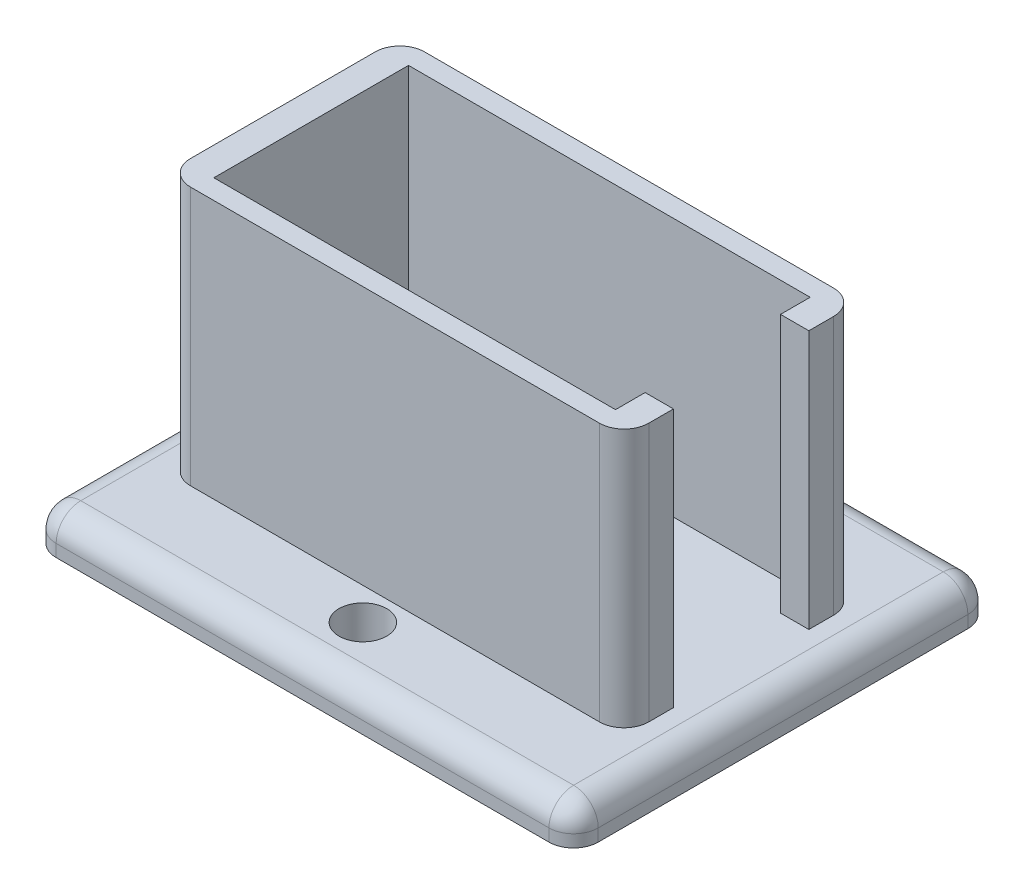
ISO-10303-21;
HEADER;
FILE_DESCRIPTION(('STEP AP214'),'2;1');
FILE_NAME('part.step','',(''),(''),'','','');
FILE_SCHEMA(('AUTOMOTIVE_DESIGN { 1 0 10303 214 1 1 1 1 }'));
ENDSEC;
DATA;
#1=APPLICATION_CONTEXT('core data for automotive mechanical design processes');
#2=APPLICATION_PROTOCOL_DEFINITION('international standard','automotive_design',2000,#1);
#3=PRODUCT_CONTEXT('',#1,'mechanical');
#4=PRODUCT('Part','Part','',(#3));
#5=PRODUCT_RELATED_PRODUCT_CATEGORY('part','',(#4));
#6=PRODUCT_DEFINITION_FORMATION('','',#4);
#7=PRODUCT_DEFINITION_CONTEXT('part definition',#1,'design');
#8=PRODUCT_DEFINITION('design','',#6,#7);
#9=PRODUCT_DEFINITION_SHAPE('','',#8);
#10=(LENGTH_UNIT() NAMED_UNIT(*) SI_UNIT(.MILLI.,.METRE.));
#11=(NAMED_UNIT(*) PLANE_ANGLE_UNIT() SI_UNIT($,.RADIAN.));
#12=(NAMED_UNIT(*) SI_UNIT($,.STERADIAN.) SOLID_ANGLE_UNIT());
#13=UNCERTAINTY_MEASURE_WITH_UNIT(LENGTH_MEASURE(1.E-05),#10,'distance_accuracy_value','');
#14=(GEOMETRIC_REPRESENTATION_CONTEXT(3) GLOBAL_UNCERTAINTY_ASSIGNED_CONTEXT((#13)) GLOBAL_UNIT_ASSIGNED_CONTEXT((#10,
#11,#12)) REPRESENTATION_CONTEXT('',''));
#15=CARTESIAN_POINT('',(0.,0.,0.));
#16=DIRECTION('',(0.,0.,1.));
#17=DIRECTION('',(1.,0.,0.));
#18=AXIS2_PLACEMENT_3D('',#15,#16,#17);
#19=CARTESIAN_POINT('',(23.622,30.48,12.065));
#20=DIRECTION('',(-1.,0.,0.));
#21=DIRECTION('',(0.,0.,1.));
#22=AXIS2_PLACEMENT_3D('',#19,#20,#21);
#23=PLANE('',#22);
#24=DIRECTION('',(0.,0.,-1.));
#25=VECTOR('',#24,1.);
#26=CARTESIAN_POINT('',(23.622,30.48,12.065));
#27=LINE('',#26,#25);
#28=CARTESIAN_POINT('',(23.622,30.48,-6.9778855003284));
#29=VERTEX_POINT('',#28);
#30=CARTESIAN_POINT('',(23.622,30.48,-9.525));
#31=VERTEX_POINT('',#30);
#32=EDGE_CURVE('E248',#29,#31,#27,.T.);
#33=ORIENTED_EDGE('',*,*,#32,.F.);
#34=DIRECTION('',(0.,1.,0.));
#35=VECTOR('',#34,1.);
#36=CARTESIAN_POINT('',(23.622,-10.6483117549332,-6.9778855003284));
#37=LINE('',#36,#35);
#38=CARTESIAN_POINT('',(23.622,3.81,-6.9778855003284));
#39=VERTEX_POINT('',#38);
#40=EDGE_CURVE('E239',#39,#29,#37,.T.);
#41=ORIENTED_EDGE('',*,*,#40,.F.);
#42=DIRECTION('',(0.,0.,-1.));
#43=VECTOR('',#42,1.);
#44=CARTESIAN_POINT('',(23.622,3.81,12.065));
#45=LINE('',#44,#43);
#46=CARTESIAN_POINT('',(23.622,3.81,-9.525));
#47=VERTEX_POINT('',#46);
#48=EDGE_CURVE('E270',#39,#47,#45,.T.);
#49=ORIENTED_EDGE('',*,*,#48,.T.);
#50=DIRECTION('',(0.,-1.,0.));
#51=VECTOR('',#50,1.);
#52=CARTESIAN_POINT('',(23.622,30.48,-9.525));
#53=LINE('',#52,#51);
#54=EDGE_CURVE('E360',#47,#31,#53,.F.);
#55=ORIENTED_EDGE('',*,*,#54,.T.);
#56=EDGE_LOOP('',(#33,#41,#49,#55));
#57=FACE_BOUND('',#56,.T.);
#58=ADVANCED_FACE('F44',(#57),#23,.F.);
#59=CARTESIAN_POINT('',(20.701,-42.1983683692434,10.033));
#60=DIRECTION('',(1.,0.,0.));
#61=DIRECTION('',(0.,0.,-1.));
#62=AXIS2_PLACEMENT_3D('',#59,#60,#61);
#63=PLANE('',#62);
#64=DIRECTION('',(0.,0.,-1.));
#65=VECTOR('',#64,1.);
#66=CARTESIAN_POINT('',(20.701,3.81,10.033));
#67=LINE('',#66,#65);
#68=CARTESIAN_POINT('',(20.701,3.81,-6.9778855003284));
#69=VERTEX_POINT('',#68);
#70=CARTESIAN_POINT('',(20.701,3.81,-10.033));
#71=VERTEX_POINT('',#70);
#72=EDGE_CURVE('E469',#69,#71,#67,.T.);
#73=ORIENTED_EDGE('',*,*,#72,.F.);
#74=DIRECTION('',(0.,1.,0.));
#75=VECTOR('',#74,1.);
#76=CARTESIAN_POINT('',(20.701,-42.1983683692434,-6.9778855003284));
#77=LINE('',#76,#75);
#78=CARTESIAN_POINT('',(20.701,30.48,-6.9778855003284));
#79=VERTEX_POINT('',#78);
#80=EDGE_CURVE('E11',#69,#79,#77,.T.);
#81=ORIENTED_EDGE('',*,*,#80,.T.);
#82=DIRECTION('',(0.,0.,-1.));
#83=VECTOR('',#82,1.);
#84=CARTESIAN_POINT('',(20.701,30.48,10.033));
#85=LINE('',#84,#83);
#86=CARTESIAN_POINT('',(20.701,30.48,-10.033));
#87=VERTEX_POINT('',#86);
#88=EDGE_CURVE('E509',#79,#87,#85,.T.);
#89=ORIENTED_EDGE('',*,*,#88,.T.);
#90=DIRECTION('',(0.,1.,0.));
#91=VECTOR('',#90,1.);
#92=CARTESIAN_POINT('',(20.701,-42.1983683692434,-10.033));
#93=LINE('',#92,#91);
#94=EDGE_CURVE('E257',#71,#87,#93,.T.);
#95=ORIENTED_EDGE('',*,*,#94,.F.);
#96=EDGE_LOOP('',(#73,#81,#89,#95));
#97=FACE_BOUND('',#96,.T.);
#98=ADVANCED_FACE('F544',(#97),#63,.F.);
#99=CARTESIAN_POINT('',(0.,0.,0.));
#100=DIRECTION('',(0.,-1.,0.));
#101=DIRECTION('',(0.,0.,-1.));
#102=AXIS2_PLACEMENT_3D('',#99,#100,#101);
#103=PLANE('',#102);
#104=CARTESIAN_POINT('',(0.,0.,15.373463192756));
#105=DIRECTION('',(0.,-1.,0.));
#106=DIRECTION('',(0.,0.,-1.));
#107=AXIS2_PLACEMENT_3D('',#104,#105,#106);
#108=CIRCLE('',#107,2.4618575720522);
#109=CARTESIAN_POINT('',(0.,0.,12.9116056207038));
#110=VERTEX_POINT('',#109);
#111=EDGE_CURVE('E524',#110,#110,#108,.T.);
#112=ORIENTED_EDGE('',*,*,#111,.F.);
#113=EDGE_LOOP('',(#112));
#114=FACE_BOUND('',#113,.T.);
#115=DIRECTION('',(0.,0.,1.));
#116=VECTOR('',#115,1.);
#117=CARTESIAN_POINT('',(-27.94,0.,21.59));
#118=LINE('',#117,#116);
#119=CARTESIAN_POINT('',(-27.94,0.,-19.05));
#120=VERTEX_POINT('',#119);
#121=CARTESIAN_POINT('',(-27.94,0.,19.05));
#122=VERTEX_POINT('',#121);
#123=EDGE_CURVE('E290',#120,#122,#118,.T.);
#124=ORIENTED_EDGE('',*,*,#123,.F.);
#125=CARTESIAN_POINT('',(-25.4,0.,-19.05));
#126=DIRECTION('',(0.,-1.,0.));
#127=DIRECTION('',(0.,0.,-1.));
#128=AXIS2_PLACEMENT_3D('',#125,#126,#127);
#129=CIRCLE('',#128,2.54);
#130=CARTESIAN_POINT('',(-25.4,0.,-21.59));
#131=VERTEX_POINT('',#130);
#132=EDGE_CURVE('E339',#120,#131,#129,.T.);
#133=ORIENTED_EDGE('',*,*,#132,.T.);
#134=DIRECTION('',(-1.,0.,0.));
#135=VECTOR('',#134,1.);
#136=CARTESIAN_POINT('',(-27.94,0.,-21.59));
#137=LINE('',#136,#135);
#138=CARTESIAN_POINT('',(25.4,0.,-21.59));
#139=VERTEX_POINT('',#138);
#140=EDGE_CURVE('E285',#139,#131,#137,.T.);
#141=ORIENTED_EDGE('',*,*,#140,.F.);
#142=CARTESIAN_POINT('',(25.4,0.,-19.05));
#143=DIRECTION('',(0.,-1.,0.));
#144=DIRECTION('',(0.,0.,-1.));
#145=AXIS2_PLACEMENT_3D('',#142,#143,#144);
#146=CIRCLE('',#145,2.54);
#147=CARTESIAN_POINT('',(27.94,0.,-19.05));
#148=VERTEX_POINT('',#147);
#149=EDGE_CURVE('E336',#139,#148,#146,.T.);
#150=ORIENTED_EDGE('',*,*,#149,.T.);
#151=DIRECTION('',(0.,0.,-1.));
#152=VECTOR('',#151,1.);
#153=CARTESIAN_POINT('',(27.94,0.,21.59));
#154=LINE('',#153,#152);
#155=CARTESIAN_POINT('',(27.94,0.,19.05));
#156=VERTEX_POINT('',#155);
#157=EDGE_CURVE('E281',#156,#148,#154,.T.);
#158=ORIENTED_EDGE('',*,*,#157,.F.);
#159=CARTESIAN_POINT('',(25.4,0.,19.05));
#160=DIRECTION('',(0.,-1.,0.));
#161=DIRECTION('',(0.,0.,-1.));
#162=AXIS2_PLACEMENT_3D('',#159,#160,#161);
#163=CIRCLE('',#162,2.54);
#164=CARTESIAN_POINT('',(25.4,0.,21.59));
#165=VERTEX_POINT('',#164);
#166=EDGE_CURVE('E333',#156,#165,#163,.T.);
#167=ORIENTED_EDGE('',*,*,#166,.T.);
#168=DIRECTION('',(1.,0.,0.));
#169=VECTOR('',#168,1.);
#170=CARTESIAN_POINT('',(-27.94,0.,21.59));
#171=LINE('',#170,#169);
#172=CARTESIAN_POINT('',(-25.4,0.,21.59));
#173=VERTEX_POINT('',#172);
#174=EDGE_CURVE('E294',#173,#165,#171,.T.);
#175=ORIENTED_EDGE('',*,*,#174,.F.);
#176=CARTESIAN_POINT('',(-25.4,0.,19.05));
#177=DIRECTION('',(0.,-1.,0.));
#178=DIRECTION('',(0.,0.,-1.));
#179=AXIS2_PLACEMENT_3D('',#176,#177,#178);
#180=CIRCLE('',#179,2.54);
#181=EDGE_CURVE('E330',#173,#122,#180,.T.);
#182=ORIENTED_EDGE('',*,*,#181,.T.);
#183=EDGE_LOOP('',(#124,#133,#141,#150,#158,#167,#175,#182));
#184=FACE_BOUND('',#183,.T.);
#185=CARTESIAN_POINT('',(0.,0.,-15.373463192756));
#186=DIRECTION('',(0.,-1.,0.));
#187=DIRECTION('',(0.,0.,-1.));
#188=AXIS2_PLACEMENT_3D('',#185,#186,#187);
#189=CIRCLE('',#188,2.4618575720522);
#190=CARTESIAN_POINT('',(0.,0.,-17.8353207648082));
#191=VERTEX_POINT('',#190);
#192=EDGE_CURVE('E511',#191,#191,#189,.F.);
#193=ORIENTED_EDGE('',*,*,#192,.T.);
#194=EDGE_LOOP('',(#193));
#195=FACE_BOUND('',#194,.T.);
#196=ADVANCED_FACE('F567',(#114,#184,#195),#103,.T.);
#197=CARTESIAN_POINT('',(27.94,3.81,21.59));
#198=DIRECTION('',(-1.,0.,0.));
#199=DIRECTION('',(0.,0.,1.));
#200=AXIS2_PLACEMENT_3D('',#197,#198,#199);
#201=PLANE('',#200);
#202=ORIENTED_EDGE('',*,*,#157,.T.);
#203=DIRECTION('',(0.,-1.,0.));
#204=VECTOR('',#203,1.);
#205=CARTESIAN_POINT('',(27.94,3.81,-19.05));
#206=LINE('',#205,#204);
#207=CARTESIAN_POINT('',(27.94,1.27,-19.05));
#208=VERTEX_POINT('',#207);
#209=EDGE_CURVE('E348',#148,#208,#206,.F.);
#210=ORIENTED_EDGE('',*,*,#209,.T.);
#211=DIRECTION('',(0.,0.,-1.));
#212=VECTOR('',#211,1.);
#213=CARTESIAN_POINT('',(27.94,1.27,21.59));
#214=LINE('',#213,#212);
#215=CARTESIAN_POINT('',(27.94,1.27,19.05));
#216=VERTEX_POINT('',#215);
#217=EDGE_CURVE('E345',#208,#216,#214,.F.);
#218=ORIENTED_EDGE('',*,*,#217,.T.);
#219=DIRECTION('',(0.,-1.,0.));
#220=VECTOR('',#219,1.);
#221=CARTESIAN_POINT('',(27.94,3.81,19.05));
#222=LINE('',#221,#220);
#223=EDGE_CURVE('E342',#216,#156,#222,.T.);
#224=ORIENTED_EDGE('',*,*,#223,.T.);
#225=EDGE_LOOP('',(#202,#210,#218,#224));
#226=FACE_BOUND('',#225,.T.);
#227=ADVANCED_FACE('F591',(#226),#201,.F.);
#228=CARTESIAN_POINT('',(-27.94,3.81,-21.59));
#229=DIRECTION('',(0.,0.,1.));
#230=DIRECTION('',(1.,0.,0.));
#231=AXIS2_PLACEMENT_3D('',#228,#229,#230);
#232=PLANE('',#231);
#233=ORIENTED_EDGE('',*,*,#140,.T.);
#234=DIRECTION('',(0.,-1.,0.));
#235=VECTOR('',#234,1.);
#236=CARTESIAN_POINT('',(-25.4,3.81,-21.59));
#237=LINE('',#236,#235);
#238=CARTESIAN_POINT('',(-25.4,1.27,-21.59));
#239=VERTEX_POINT('',#238);
#240=EDGE_CURVE('E318',#131,#239,#237,.F.);
#241=ORIENTED_EDGE('',*,*,#240,.T.);
#242=DIRECTION('',(-1.,0.,0.));
#243=VECTOR('',#242,1.);
#244=CARTESIAN_POINT('',(-27.94,1.27,-21.59));
#245=LINE('',#244,#243);
#246=CARTESIAN_POINT('',(25.4,1.27,-21.59));
#247=VERTEX_POINT('',#246);
#248=EDGE_CURVE('E314',#239,#247,#245,.F.);
#249=ORIENTED_EDGE('',*,*,#248,.T.);
#250=DIRECTION('',(0.,-1.,0.));
#251=VECTOR('',#250,1.);
#252=CARTESIAN_POINT('',(25.4,3.81,-21.59));
#253=LINE('',#252,#251);
#254=EDGE_CURVE('E311',#247,#139,#253,.T.);
#255=ORIENTED_EDGE('',*,*,#254,.T.);
#256=EDGE_LOOP('',(#233,#241,#249,#255));
#257=FACE_BOUND('',#256,.T.);
#258=ADVANCED_FACE('F776',(#257),#232,.F.);
#259=CARTESIAN_POINT('',(-27.94,3.81,21.59));
#260=DIRECTION('',(1.,0.,0.));
#261=DIRECTION('',(0.,0.,-1.));
#262=AXIS2_PLACEMENT_3D('',#259,#260,#261);
#263=PLANE('',#262);
#264=DIRECTION('',(0.,0.,1.));
#265=VECTOR('',#264,1.);
#266=CARTESIAN_POINT('',(-27.94,1.27,21.59));
#267=LINE('',#266,#265);
#268=CARTESIAN_POINT('',(-27.94,1.27,19.05));
#269=VERTEX_POINT('',#268);
#270=CARTESIAN_POINT('',(-27.94,1.27,-19.05));
#271=VERTEX_POINT('',#270);
#272=EDGE_CURVE('E324',#269,#271,#267,.F.);
#273=ORIENTED_EDGE('',*,*,#272,.T.);
#274=DIRECTION('',(0.,-1.,0.));
#275=VECTOR('',#274,1.);
#276=CARTESIAN_POINT('',(-27.94,3.81,-19.05));
#277=LINE('',#276,#275);
#278=EDGE_CURVE('E327',#271,#120,#277,.T.);
#279=ORIENTED_EDGE('',*,*,#278,.T.);
#280=ORIENTED_EDGE('',*,*,#123,.T.);
#281=DIRECTION('',(0.,-1.,0.));
#282=VECTOR('',#281,1.);
#283=CARTESIAN_POINT('',(-27.94,3.81,19.05));
#284=LINE('',#283,#282);
#285=EDGE_CURVE('E321',#122,#269,#284,.F.);
#286=ORIENTED_EDGE('',*,*,#285,.T.);
#287=EDGE_LOOP('',(#273,#279,#280,#286));
#288=FACE_BOUND('',#287,.T.);
#289=ADVANCED_FACE('F766',(#288),#263,.F.);
#290=CARTESIAN_POINT('',(-27.94,3.81,21.59));
#291=DIRECTION('',(0.,0.,-1.));
#292=DIRECTION('',(-1.,0.,0.));
#293=AXIS2_PLACEMENT_3D('',#290,#291,#292);
#294=PLANE('',#293);
#295=ORIENTED_EDGE('',*,*,#174,.T.);
#296=DIRECTION('',(0.,-1.,0.));
#297=VECTOR('',#296,1.);
#298=CARTESIAN_POINT('',(25.4,3.81,21.59));
#299=LINE('',#298,#297);
#300=CARTESIAN_POINT('',(25.4,1.27,21.59));
#301=VERTEX_POINT('',#300);
#302=EDGE_CURVE('E357',#165,#301,#299,.F.);
#303=ORIENTED_EDGE('',*,*,#302,.T.);
#304=DIRECTION('',(1.,0.,0.));
#305=VECTOR('',#304,1.);
#306=CARTESIAN_POINT('',(-27.94,1.27,21.59));
#307=LINE('',#306,#305);
#308=CARTESIAN_POINT('',(-25.4,1.27,21.59));
#309=VERTEX_POINT('',#308);
#310=EDGE_CURVE('E354',#301,#309,#307,.F.);
#311=ORIENTED_EDGE('',*,*,#310,.T.);
#312=DIRECTION('',(0.,-1.,0.));
#313=VECTOR('',#312,1.);
#314=CARTESIAN_POINT('',(-25.4,3.81,21.59));
#315=LINE('',#314,#313);
#316=EDGE_CURVE('E351',#309,#173,#315,.T.);
#317=ORIENTED_EDGE('',*,*,#316,.T.);
#318=EDGE_LOOP('',(#295,#303,#311,#317));
#319=FACE_BOUND('',#318,.T.);
#320=ADVANCED_FACE('F632',(#319),#294,.F.);
#321=CARTESIAN_POINT('',(25.4,3.81,19.05));
#322=DIRECTION('',(0.,-1.,0.));
#323=DIRECTION('',(0.,0.,-1.));
#324=AXIS2_PLACEMENT_3D('',#321,#322,#323);
#325=CYLINDRICAL_SURFACE('',#324,2.54);
#326=ORIENTED_EDGE('',*,*,#166,.F.);
#327=ORIENTED_EDGE('',*,*,#223,.F.);
#328=CARTESIAN_POINT('',(25.4,1.27,19.05));
#329=DIRECTION('',(0.,1.,0.));
#330=DIRECTION('',(0.,0.,1.));
#331=AXIS2_PLACEMENT_3D('',#328,#329,#330);
#332=CIRCLE('',#331,2.54);
#333=EDGE_CURVE('E286',#301,#216,#332,.T.);
#334=ORIENTED_EDGE('',*,*,#333,.F.);
#335=ORIENTED_EDGE('',*,*,#302,.F.);
#336=EDGE_LOOP('',(#326,#327,#334,#335));
#337=FACE_BOUND('',#336,.T.);
#338=ADVANCED_FACE('F628',(#337),#325,.T.);
#339=CARTESIAN_POINT('',(0.,1.27,19.05));
#340=DIRECTION('',(1.,0.,0.));
#341=DIRECTION('',(0.,0.,-1.));
#342=AXIS2_PLACEMENT_3D('',#339,#340,#341);
#343=CYLINDRICAL_SURFACE('',#342,2.54);
#344=CARTESIAN_POINT('',(-25.4,1.27,19.05));
#345=DIRECTION('',(-1.,0.,0.));
#346=DIRECTION('',(0.,0.,1.));
#347=AXIS2_PLACEMENT_3D('',#344,#345,#346);
#348=CIRCLE('',#347,2.54);
#349=CARTESIAN_POINT('',(-25.4,3.81,19.05));
#350=VERTEX_POINT('',#349);
#351=EDGE_CURVE('E394',#309,#350,#348,.T.);
#352=ORIENTED_EDGE('',*,*,#351,.F.);
#353=ORIENTED_EDGE('',*,*,#310,.F.);
#354=CARTESIAN_POINT('',(25.4,1.27,19.05));
#355=DIRECTION('',(1.,0.,0.));
#356=DIRECTION('',(0.,0.,-1.));
#357=AXIS2_PLACEMENT_3D('',#354,#355,#356);
#358=CIRCLE('',#357,2.54);
#359=CARTESIAN_POINT('',(25.4,3.81,19.05));
#360=VERTEX_POINT('',#359);
#361=EDGE_CURVE('E398',#360,#301,#358,.T.);
#362=ORIENTED_EDGE('',*,*,#361,.F.);
#363=DIRECTION('',(1.,0.,0.));
#364=VECTOR('',#363,1.);
#365=CARTESIAN_POINT('',(0.,3.81,19.05));
#366=LINE('',#365,#364);
#367=EDGE_CURVE('E298',#350,#360,#366,.T.);
#368=ORIENTED_EDGE('',*,*,#367,.F.);
#369=EDGE_LOOP('',(#352,#353,#362,#368));
#370=FACE_BOUND('',#369,.T.);
#371=ADVANCED_FACE('F624',(#370),#343,.T.);
#372=CARTESIAN_POINT('',(-25.4,3.81,19.05));
#373=DIRECTION('',(0.,-1.,0.));
#374=DIRECTION('',(0.,0.,-1.));
#375=AXIS2_PLACEMENT_3D('',#372,#373,#374);
#376=CYLINDRICAL_SURFACE('',#375,2.54);
#377=ORIENTED_EDGE('',*,*,#181,.F.);
#378=ORIENTED_EDGE('',*,*,#316,.F.);
#379=CARTESIAN_POINT('',(-25.4,1.27,19.05));
#380=DIRECTION('',(0.,1.,0.));
#381=DIRECTION('',(0.,0.,1.));
#382=AXIS2_PLACEMENT_3D('',#379,#380,#381);
#383=CIRCLE('',#382,2.54);
#384=EDGE_CURVE('E390',#269,#309,#383,.T.);
#385=ORIENTED_EDGE('',*,*,#384,.F.);
#386=ORIENTED_EDGE('',*,*,#285,.F.);
#387=EDGE_LOOP('',(#377,#378,#385,#386));
#388=FACE_BOUND('',#387,.T.);
#389=ADVANCED_FACE('F620',(#388),#376,.T.);
#390=CARTESIAN_POINT('',(25.4,1.27,19.05));
#391=DIRECTION('',(0.,0.,1.));
#392=DIRECTION('',(1.,0.,0.));
#393=AXIS2_PLACEMENT_3D('',#390,#391,#392);
#394=SPHERICAL_SURFACE('',#393,2.54);
#395=ORIENTED_EDGE('',*,*,#361,.T.);
#396=ORIENTED_EDGE('',*,*,#333,.T.);
#397=CARTESIAN_POINT('',(25.4,1.27,19.05));
#398=DIRECTION('',(0.,0.,1.));
#399=DIRECTION('',(1.,0.,0.));
#400=AXIS2_PLACEMENT_3D('',#397,#398,#399);
#401=CIRCLE('',#400,2.54);
#402=EDGE_CURVE('E386',#360,#216,#401,.F.);
#403=ORIENTED_EDGE('',*,*,#402,.F.);
#404=EDGE_LOOP('',(#395,#396,#403));
#405=FACE_BOUND('',#404,.T.);
#406=ADVANCED_FACE('F616',(#405),#394,.T.);
#407=CARTESIAN_POINT('',(-25.4,1.27,19.05));
#408=DIRECTION('',(0.,0.,1.));
#409=DIRECTION('',(1.,0.,0.));
#410=AXIS2_PLACEMENT_3D('',#407,#408,#409);
#411=SPHERICAL_SURFACE('',#410,2.54);
#412=ORIENTED_EDGE('',*,*,#384,.T.);
#413=ORIENTED_EDGE('',*,*,#351,.T.);
#414=CARTESIAN_POINT('',(-25.4,1.27,19.05));
#415=DIRECTION('',(0.,0.,1.));
#416=DIRECTION('',(1.,0.,0.));
#417=AXIS2_PLACEMENT_3D('',#414,#415,#416);
#418=CIRCLE('',#417,2.54);
#419=EDGE_CURVE('E382',#269,#350,#418,.F.);
#420=ORIENTED_EDGE('',*,*,#419,.F.);
#421=EDGE_LOOP('',(#412,#413,#420));
#422=FACE_BOUND('',#421,.T.);
#423=ADVANCED_FACE('F612',(#422),#411,.T.);
#424=CARTESIAN_POINT('',(25.4,3.81,-19.05));
#425=DIRECTION('',(0.,-1.,0.));
#426=DIRECTION('',(0.,0.,-1.));
#427=AXIS2_PLACEMENT_3D('',#424,#425,#426);
#428=CYLINDRICAL_SURFACE('',#427,2.54);
#429=ORIENTED_EDGE('',*,*,#149,.F.);
#430=ORIENTED_EDGE('',*,*,#254,.F.);
#431=CARTESIAN_POINT('',(25.4,1.27,-19.05));
#432=DIRECTION('',(0.,1.,0.));
#433=DIRECTION('',(0.,0.,1.));
#434=AXIS2_PLACEMENT_3D('',#431,#432,#433);
#435=CIRCLE('',#434,2.54);
#436=EDGE_CURVE('E378',#208,#247,#435,.T.);
#437=ORIENTED_EDGE('',*,*,#436,.F.);
#438=ORIENTED_EDGE('',*,*,#209,.F.);
#439=EDGE_LOOP('',(#429,#430,#437,#438));
#440=FACE_BOUND('',#439,.T.);
#441=ADVANCED_FACE('F608',(#440),#428,.T.);
#442=CARTESIAN_POINT('',(25.4,1.27,0.));
#443=DIRECTION('',(0.,0.,-1.));
#444=DIRECTION('',(-1.,0.,0.));
#445=AXIS2_PLACEMENT_3D('',#442,#443,#444);
#446=CYLINDRICAL_SURFACE('',#445,2.54);
#447=ORIENTED_EDGE('',*,*,#402,.T.);
#448=ORIENTED_EDGE('',*,*,#217,.F.);
#449=CARTESIAN_POINT('',(25.4,1.27,-19.05));
#450=DIRECTION('',(0.,0.,-1.));
#451=DIRECTION('',(-1.,0.,0.));
#452=AXIS2_PLACEMENT_3D('',#449,#450,#451);
#453=CIRCLE('',#452,2.54);
#454=CARTESIAN_POINT('',(25.4,3.81,-19.05));
#455=VERTEX_POINT('',#454);
#456=EDGE_CURVE('E374',#455,#208,#453,.T.);
#457=ORIENTED_EDGE('',*,*,#456,.F.);
#458=DIRECTION('',(0.,0.,-1.));
#459=VECTOR('',#458,1.);
#460=CARTESIAN_POINT('',(25.4,3.81,0.));
#461=LINE('',#460,#459);
#462=EDGE_CURVE('E301',#360,#455,#461,.T.);
#463=ORIENTED_EDGE('',*,*,#462,.F.);
#464=EDGE_LOOP('',(#447,#448,#457,#463));
#465=FACE_BOUND('',#464,.T.);
#466=ADVANCED_FACE('F604',(#465),#446,.T.);
#467=CARTESIAN_POINT('',(-25.4,1.27,0.));
#468=DIRECTION('',(0.,0.,1.));
#469=DIRECTION('',(1.,0.,0.));
#470=AXIS2_PLACEMENT_3D('',#467,#468,#469);
#471=CYLINDRICAL_SURFACE('',#470,2.54);
#472=ORIENTED_EDGE('',*,*,#419,.T.);
#473=DIRECTION('',(0.,0.,1.));
#474=VECTOR('',#473,1.);
#475=CARTESIAN_POINT('',(-25.4,3.81,0.));
#476=LINE('',#475,#474);
#477=CARTESIAN_POINT('',(-25.4,3.81,-19.05));
#478=VERTEX_POINT('',#477);
#479=EDGE_CURVE('E304',#478,#350,#476,.T.);
#480=ORIENTED_EDGE('',*,*,#479,.F.);
#481=CARTESIAN_POINT('',(-25.4,1.27,-19.05));
#482=DIRECTION('',(0.,0.,-1.));
#483=DIRECTION('',(0.,1.,0.));
#484=AXIS2_PLACEMENT_3D('',#481,#482,#483);
#485=CIRCLE('',#484,2.54);
#486=EDGE_CURVE('E370',#271,#478,#485,.T.);
#487=ORIENTED_EDGE('',*,*,#486,.F.);
#488=ORIENTED_EDGE('',*,*,#272,.F.);
#489=EDGE_LOOP('',(#472,#480,#487,#488));
#490=FACE_BOUND('',#489,.T.);
#491=ADVANCED_FACE('F600',(#490),#471,.T.);
#492=CARTESIAN_POINT('',(-25.4,3.81,-19.05));
#493=DIRECTION('',(0.,-1.,0.));
#494=DIRECTION('',(0.,0.,-1.));
#495=AXIS2_PLACEMENT_3D('',#492,#493,#494);
#496=CYLINDRICAL_SURFACE('',#495,2.54);
#497=ORIENTED_EDGE('',*,*,#132,.F.);
#498=ORIENTED_EDGE('',*,*,#278,.F.);
#499=CARTESIAN_POINT('',(-25.4,1.27,-19.05));
#500=DIRECTION('',(0.,1.,0.));
#501=DIRECTION('',(0.,0.,1.));
#502=AXIS2_PLACEMENT_3D('',#499,#500,#501);
#503=CIRCLE('',#502,2.54);
#504=EDGE_CURVE('E366',#239,#271,#503,.T.);
#505=ORIENTED_EDGE('',*,*,#504,.F.);
#506=ORIENTED_EDGE('',*,*,#240,.F.);
#507=EDGE_LOOP('',(#497,#498,#505,#506));
#508=FACE_BOUND('',#507,.T.);
#509=ADVANCED_FACE('F596',(#508),#496,.T.);
#510=CARTESIAN_POINT('',(25.4,1.27,-19.05));
#511=DIRECTION('',(1.,0.,0.));
#512=DIRECTION('',(0.,0.,-1.));
#513=AXIS2_PLACEMENT_3D('',#510,#511,#512);
#514=SPHERICAL_SURFACE('',#513,2.54);
#515=ORIENTED_EDGE('',*,*,#456,.T.);
#516=ORIENTED_EDGE('',*,*,#436,.T.);
#517=CARTESIAN_POINT('',(25.4,1.27,-19.05));
#518=DIRECTION('',(1.,0.,0.));
#519=DIRECTION('',(0.,0.,-1.));
#520=AXIS2_PLACEMENT_3D('',#517,#518,#519);
#521=CIRCLE('',#520,2.54);
#522=EDGE_CURVE('E363',#455,#247,#521,.F.);
#523=ORIENTED_EDGE('',*,*,#522,.F.);
#524=EDGE_LOOP('',(#515,#516,#523));
#525=FACE_BOUND('',#524,.T.);
#526=ADVANCED_FACE('F587',(#525),#514,.T.);
#527=CARTESIAN_POINT('',(-25.4,1.27,-19.05));
#528=DIRECTION('',(-1.,0.,0.));
#529=DIRECTION('',(0.,0.,1.));
#530=AXIS2_PLACEMENT_3D('',#527,#528,#529);
#531=SPHERICAL_SURFACE('',#530,2.54);
#532=ORIENTED_EDGE('',*,*,#504,.T.);
#533=ORIENTED_EDGE('',*,*,#486,.T.);
#534=CARTESIAN_POINT('',(-25.4,1.27,-19.05));
#535=DIRECTION('',(-1.,0.,0.));
#536=DIRECTION('',(0.,0.,1.));
#537=AXIS2_PLACEMENT_3D('',#534,#535,#536);
#538=CIRCLE('',#537,2.54);
#539=EDGE_CURVE('E266',#239,#478,#538,.F.);
#540=ORIENTED_EDGE('',*,*,#539,.F.);
#541=EDGE_LOOP('',(#532,#533,#540));
#542=FACE_BOUND('',#541,.T.);
#543=ADVANCED_FACE('F581',(#542),#531,.T.);
#544=CARTESIAN_POINT('',(0.,1.27,-19.05));
#545=DIRECTION('',(-1.,0.,0.));
#546=DIRECTION('',(0.,0.,1.));
#547=AXIS2_PLACEMENT_3D('',#544,#545,#546);
#548=CYLINDRICAL_SURFACE('',#547,2.54);
#549=ORIENTED_EDGE('',*,*,#522,.T.);
#550=ORIENTED_EDGE('',*,*,#248,.F.);
#551=ORIENTED_EDGE('',*,*,#539,.T.);
#552=DIRECTION('',(-1.,0.,0.));
#553=VECTOR('',#552,1.);
#554=CARTESIAN_POINT('',(0.,3.81,-19.05));
#555=LINE('',#554,#553);
#556=EDGE_CURVE('E307',#455,#478,#555,.T.);
#557=ORIENTED_EDGE('',*,*,#556,.F.);
#558=EDGE_LOOP('',(#549,#550,#551,#557));
#559=FACE_BOUND('',#558,.T.);
#560=ADVANCED_FACE('F573',(#559),#548,.T.);
#561=CARTESIAN_POINT('',(23.622,3.81,9.525));
#562=VERTEX_POINT('',#561);
#563=CARTESIAN_POINT('',(23.622,3.81,6.9778855003284));
#564=VERTEX_POINT('',#563);
#565=EDGE_CURVE('E237',#562,#564,#45,.T.);
#566=ORIENTED_EDGE('',*,*,#565,.T.);
#567=DIRECTION('',(0.,1.,0.));
#568=VECTOR('',#567,1.);
#569=CARTESIAN_POINT('',(23.622,-10.6483117549332,6.9778855003284));
#570=LINE('',#569,#568);
#571=CARTESIAN_POINT('',(23.622,30.48,6.9778855003284));
#572=VERTEX_POINT('',#571);
#573=EDGE_CURVE('E220',#564,#572,#570,.T.);
#574=ORIENTED_EDGE('',*,*,#573,.T.);
#575=CARTESIAN_POINT('',(23.622,30.48,9.525));
#576=VERTEX_POINT('',#575);
#577=EDGE_CURVE('E234',#576,#572,#27,.T.);
#578=ORIENTED_EDGE('',*,*,#577,.F.);
#579=DIRECTION('',(0.,-1.,0.));
#580=VECTOR('',#579,1.);
#581=CARTESIAN_POINT('',(23.622,30.48,9.525));
#582=LINE('',#581,#580);
#583=EDGE_CURVE('E408',#576,#562,#582,.T.);
#584=ORIENTED_EDGE('',*,*,#583,.T.);
#585=EDGE_LOOP('',(#566,#574,#578,#584));
#586=FACE_BOUND('',#585,.T.);
#587=ADVANCED_FACE('F232',(#586),#23,.F.);
#588=CARTESIAN_POINT('',(-23.622,30.48,-12.065));
#589=DIRECTION('',(0.,0.,1.));
#590=DIRECTION('',(1.,0.,0.));
#591=AXIS2_PLACEMENT_3D('',#588,#589,#590);
#592=PLANE('',#591);
#593=DIRECTION('',(-1.,0.,0.));
#594=VECTOR('',#593,1.);
#595=CARTESIAN_POINT('',(-23.622,30.48,-12.065));
#596=LINE('',#595,#594);
#597=CARTESIAN_POINT('',(21.082,30.48,-12.065));
#598=VERTEX_POINT('',#597);
#599=CARTESIAN_POINT('',(-21.082,30.48,-12.065));
#600=VERTEX_POINT('',#599);
#601=EDGE_CURVE('E247',#598,#600,#596,.T.);
#602=ORIENTED_EDGE('',*,*,#601,.F.);
#603=DIRECTION('',(0.,-1.,0.));
#604=VECTOR('',#603,1.);
#605=CARTESIAN_POINT('',(21.082,30.48,-12.065));
#606=LINE('',#605,#604);
#607=CARTESIAN_POINT('',(21.082,3.81,-12.065));
#608=VERTEX_POINT('',#607);
#609=EDGE_CURVE('E432',#598,#608,#606,.T.);
#610=ORIENTED_EDGE('',*,*,#609,.T.);
#611=DIRECTION('',(-1.,0.,0.));
#612=VECTOR('',#611,1.);
#613=CARTESIAN_POINT('',(-23.622,3.81,-12.065));
#614=LINE('',#613,#612);
#615=CARTESIAN_POINT('',(-21.082,3.81,-12.065));
#616=VERTEX_POINT('',#615);
#617=EDGE_CURVE('E269',#608,#616,#614,.T.);
#618=ORIENTED_EDGE('',*,*,#617,.T.);
#619=DIRECTION('',(0.,-1.,0.));
#620=VECTOR('',#619,1.);
#621=CARTESIAN_POINT('',(-21.082,30.48,-12.065));
#622=LINE('',#621,#620);
#623=EDGE_CURVE('E429',#616,#600,#622,.F.);
#624=ORIENTED_EDGE('',*,*,#623,.T.);
#625=EDGE_LOOP('',(#602,#610,#618,#624));
#626=FACE_BOUND('',#625,.T.);
#627=ADVANCED_FACE('F572',(#626),#592,.F.);
#628=CARTESIAN_POINT('',(-23.622,30.48,12.065));
#629=DIRECTION('',(1.,0.,0.));
#630=DIRECTION('',(0.,0.,-1.));
#631=AXIS2_PLACEMENT_3D('',#628,#629,#630);
#632=PLANE('',#631);
#633=DIRECTION('',(0.,0.,1.));
#634=VECTOR('',#633,1.);
#635=CARTESIAN_POINT('',(-23.622,30.48,12.065));
#636=LINE('',#635,#634);
#637=CARTESIAN_POINT('',(-23.622,30.48,-9.525));
#638=VERTEX_POINT('',#637);
#639=CARTESIAN_POINT('',(-23.622,30.48,9.525));
#640=VERTEX_POINT('',#639);
#641=EDGE_CURVE('E253',#638,#640,#636,.T.);
#642=ORIENTED_EDGE('',*,*,#641,.F.);
#643=DIRECTION('',(0.,-1.,0.));
#644=VECTOR('',#643,1.);
#645=CARTESIAN_POINT('',(-23.622,30.48,-9.525));
#646=LINE('',#645,#644);
#647=CARTESIAN_POINT('',(-23.622,3.81,-9.525));
#648=VERTEX_POINT('',#647);
#649=EDGE_CURVE('E439',#638,#648,#646,.T.);
#650=ORIENTED_EDGE('',*,*,#649,.T.);
#651=DIRECTION('',(0.,0.,1.));
#652=VECTOR('',#651,1.);
#653=CARTESIAN_POINT('',(-23.622,3.81,12.065));
#654=LINE('',#653,#652);
#655=CARTESIAN_POINT('',(-23.622,3.81,9.525));
#656=VERTEX_POINT('',#655);
#657=EDGE_CURVE('E274',#648,#656,#654,.T.);
#658=ORIENTED_EDGE('',*,*,#657,.T.);
#659=DIRECTION('',(0.,-1.,0.));
#660=VECTOR('',#659,1.);
#661=CARTESIAN_POINT('',(-23.622,30.48,9.525));
#662=LINE('',#661,#660);
#663=EDGE_CURVE('E436',#656,#640,#662,.F.);
#664=ORIENTED_EDGE('',*,*,#663,.T.);
#665=EDGE_LOOP('',(#642,#650,#658,#664));
#666=FACE_BOUND('',#665,.T.);
#667=ADVANCED_FACE('F578',(#666),#632,.F.);
#668=CARTESIAN_POINT('',(-23.622,30.48,12.065));
#669=DIRECTION('',(0.,0.,-1.));
#670=DIRECTION('',(-1.,0.,0.));
#671=AXIS2_PLACEMENT_3D('',#668,#669,#670);
#672=PLANE('',#671);
#673=DIRECTION('',(1.,0.,0.));
#674=VECTOR('',#673,1.);
#675=CARTESIAN_POINT('',(-23.622,3.81,12.065));
#676=LINE('',#675,#674);
#677=CARTESIAN_POINT('',(-21.082,3.81,12.065));
#678=VERTEX_POINT('',#677);
#679=CARTESIAN_POINT('',(21.082,3.81,12.065));
#680=VERTEX_POINT('',#679);
#681=EDGE_CURVE('E255',#678,#680,#676,.T.);
#682=ORIENTED_EDGE('',*,*,#681,.T.);
#683=DIRECTION('',(0.,-1.,0.));
#684=VECTOR('',#683,1.);
#685=CARTESIAN_POINT('',(21.082,30.48,12.065));
#686=LINE('',#685,#684);
#687=CARTESIAN_POINT('',(21.082,30.48,12.065));
#688=VERTEX_POINT('',#687);
#689=EDGE_CURVE('E415',#680,#688,#686,.F.);
#690=ORIENTED_EDGE('',*,*,#689,.T.);
#691=DIRECTION('',(1.,0.,0.));
#692=VECTOR('',#691,1.);
#693=CARTESIAN_POINT('',(-23.622,30.48,12.065));
#694=LINE('',#693,#692);
#695=CARTESIAN_POINT('',(-21.082,30.48,12.065));
#696=VERTEX_POINT('',#695);
#697=EDGE_CURVE('E263',#696,#688,#694,.T.);
#698=ORIENTED_EDGE('',*,*,#697,.F.);
#699=DIRECTION('',(0.,-1.,0.));
#700=VECTOR('',#699,1.);
#701=CARTESIAN_POINT('',(-21.082,30.48,12.065));
#702=LINE('',#701,#700);
#703=EDGE_CURVE('E411',#696,#678,#702,.T.);
#704=ORIENTED_EDGE('',*,*,#703,.T.);
#705=EDGE_LOOP('',(#682,#690,#698,#704));
#706=FACE_BOUND('',#705,.T.);
#707=ADVANCED_FACE('F659',(#706),#672,.F.);
#708=CARTESIAN_POINT('',(0.,30.48,0.));
#709=DIRECTION('',(0.,-1.,0.));
#710=DIRECTION('',(0.,0.,-1.));
#711=AXIS2_PLACEMENT_3D('',#708,#709,#710);
#712=PLANE('',#711);
#713=ORIENTED_EDGE('',*,*,#88,.F.);
#714=DIRECTION('',(-1.,0.,0.));
#715=VECTOR('',#714,1.);
#716=CARTESIAN_POINT('',(19.8432125516157,30.48,-6.9778855003284));
#717=LINE('',#716,#715);
#718=EDGE_CURVE('E228',#29,#79,#717,.T.);
#719=ORIENTED_EDGE('',*,*,#718,.F.);
#720=ORIENTED_EDGE('',*,*,#32,.T.);
#721=CARTESIAN_POINT('',(21.082,30.48,-9.525));
#722=DIRECTION('',(0.,-1.,0.));
#723=DIRECTION('',(0.,0.,-1.));
#724=AXIS2_PLACEMENT_3D('',#721,#722,#723);
#725=CIRCLE('',#724,2.54);
#726=EDGE_CURVE('E424',#31,#598,#725,.F.);
#727=ORIENTED_EDGE('',*,*,#726,.T.);
#728=ORIENTED_EDGE('',*,*,#601,.T.);
#729=CARTESIAN_POINT('',(-21.082,30.48,-9.525));
#730=DIRECTION('',(0.,-1.,0.));
#731=DIRECTION('',(0.,0.,-1.));
#732=AXIS2_PLACEMENT_3D('',#729,#730,#731);
#733=CIRCLE('',#732,2.54);
#734=EDGE_CURVE('E421',#600,#638,#733,.F.);
#735=ORIENTED_EDGE('',*,*,#734,.T.);
#736=ORIENTED_EDGE('',*,*,#641,.T.);
#737=CARTESIAN_POINT('',(-21.082,30.48,9.525));
#738=DIRECTION('',(0.,-1.,0.));
#739=DIRECTION('',(0.,0.,-1.));
#740=AXIS2_PLACEMENT_3D('',#737,#738,#739);
#741=CIRCLE('',#740,2.54);
#742=EDGE_CURVE('E418',#640,#696,#741,.F.);
#743=ORIENTED_EDGE('',*,*,#742,.T.);
#744=ORIENTED_EDGE('',*,*,#697,.T.);
#745=CARTESIAN_POINT('',(21.082,30.48,9.525));
#746=DIRECTION('',(0.,-1.,0.));
#747=DIRECTION('',(0.,0.,-1.));
#748=AXIS2_PLACEMENT_3D('',#745,#746,#747);
#749=CIRCLE('',#748,2.54);
#750=EDGE_CURVE('E245',#688,#576,#749,.F.);
#751=ORIENTED_EDGE('',*,*,#750,.T.);
#752=ORIENTED_EDGE('',*,*,#577,.T.);
#753=DIRECTION('',(1.,0.,0.));
#754=VECTOR('',#753,1.);
#755=CARTESIAN_POINT('',(19.8432125516157,30.48,6.9778855003284));
#756=LINE('',#755,#754);
#757=CARTESIAN_POINT('',(20.701,30.48,6.9778855003284));
#758=VERTEX_POINT('',#757);
#759=EDGE_CURVE('E217',#758,#572,#756,.T.);
#760=ORIENTED_EDGE('',*,*,#759,.F.);
#761=CARTESIAN_POINT('',(20.701,30.48,10.033));
#762=VERTEX_POINT('',#761);
#763=EDGE_CURVE('E460',#762,#758,#85,.T.);
#764=ORIENTED_EDGE('',*,*,#763,.F.);
#765=DIRECTION('',(1.,0.,0.));
#766=VECTOR('',#765,1.);
#767=CARTESIAN_POINT('',(-20.701,30.48,10.033));
#768=LINE('',#767,#766);
#769=CARTESIAN_POINT('',(-20.701,30.48,10.033));
#770=VERTEX_POINT('',#769);
#771=EDGE_CURVE('E68',#770,#762,#768,.T.);
#772=ORIENTED_EDGE('',*,*,#771,.F.);
#773=DIRECTION('',(0.,0.,1.));
#774=VECTOR('',#773,1.);
#775=CARTESIAN_POINT('',(-20.701,30.48,10.033));
#776=LINE('',#775,#774);
#777=CARTESIAN_POINT('',(-20.701,30.48,-10.033));
#778=VERTEX_POINT('',#777);
#779=EDGE_CURVE('E498',#778,#770,#776,.T.);
#780=ORIENTED_EDGE('',*,*,#779,.F.);
#781=DIRECTION('',(-1.,0.,0.));
#782=VECTOR('',#781,1.);
#783=CARTESIAN_POINT('',(-20.701,30.48,-10.033));
#784=LINE('',#783,#782);
#785=EDGE_CURVE('E501',#87,#778,#784,.T.);
#786=ORIENTED_EDGE('',*,*,#785,.F.);
#787=EDGE_LOOP('',(#713,#719,#720,#727,#728,#735,#736,#743,#744,#751,#752,#760,#764,#772,#780,#786));
#788=FACE_BOUND('',#787,.T.);
#789=ADVANCED_FACE('F242',(#788),#712,.F.);
#790=CARTESIAN_POINT('',(21.082,30.48,9.525));
#791=DIRECTION('',(0.,-1.,0.));
#792=DIRECTION('',(0.,0.,-1.));
#793=AXIS2_PLACEMENT_3D('',#790,#791,#792);
#794=CYLINDRICAL_SURFACE('',#793,2.54);
#795=ORIENTED_EDGE('',*,*,#750,.F.);
#796=ORIENTED_EDGE('',*,*,#689,.F.);
#797=CARTESIAN_POINT('',(21.082,3.81,9.525));
#798=DIRECTION('',(0.,-1.,0.));
#799=DIRECTION('',(0.,0.,-1.));
#800=AXIS2_PLACEMENT_3D('',#797,#798,#799);
#801=CIRCLE('',#800,2.54);
#802=EDGE_CURVE('E443',#562,#680,#801,.T.);
#803=ORIENTED_EDGE('',*,*,#802,.F.);
#804=ORIENTED_EDGE('',*,*,#583,.F.);
#805=EDGE_LOOP('',(#795,#796,#803,#804));
#806=FACE_BOUND('',#805,.T.);
#807=ADVANCED_FACE('F634',(#806),#794,.T.);
#808=CARTESIAN_POINT('',(21.082,30.48,-9.525));
#809=DIRECTION('',(0.,-1.,0.));
#810=DIRECTION('',(0.,0.,-1.));
#811=AXIS2_PLACEMENT_3D('',#808,#809,#810);
#812=CYLINDRICAL_SURFACE('',#811,2.54);
#813=ORIENTED_EDGE('',*,*,#726,.F.);
#814=ORIENTED_EDGE('',*,*,#54,.F.);
#815=CARTESIAN_POINT('',(21.082,3.81,-9.525));
#816=DIRECTION('',(0.,-1.,0.));
#817=DIRECTION('',(0.,0.,-1.));
#818=AXIS2_PLACEMENT_3D('',#815,#816,#817);
#819=CIRCLE('',#818,2.54);
#820=EDGE_CURVE('E446',#608,#47,#819,.T.);
#821=ORIENTED_EDGE('',*,*,#820,.F.);
#822=ORIENTED_EDGE('',*,*,#609,.F.);
#823=EDGE_LOOP('',(#813,#814,#821,#822));
#824=FACE_BOUND('',#823,.T.);
#825=ADVANCED_FACE('F637',(#824),#812,.T.);
#826=CARTESIAN_POINT('',(-21.082,30.48,-9.525));
#827=DIRECTION('',(0.,-1.,0.));
#828=DIRECTION('',(0.,0.,-1.));
#829=AXIS2_PLACEMENT_3D('',#826,#827,#828);
#830=CYLINDRICAL_SURFACE('',#829,2.54);
#831=ORIENTED_EDGE('',*,*,#734,.F.);
#832=ORIENTED_EDGE('',*,*,#623,.F.);
#833=CARTESIAN_POINT('',(-21.082,3.81,-9.525));
#834=DIRECTION('',(0.,-1.,0.));
#835=DIRECTION('',(0.,0.,-1.));
#836=AXIS2_PLACEMENT_3D('',#833,#834,#835);
#837=CIRCLE('',#836,2.54);
#838=EDGE_CURVE('E450',#648,#616,#837,.T.);
#839=ORIENTED_EDGE('',*,*,#838,.F.);
#840=ORIENTED_EDGE('',*,*,#649,.F.);
#841=EDGE_LOOP('',(#831,#832,#839,#840));
#842=FACE_BOUND('',#841,.T.);
#843=ADVANCED_FACE('F640',(#842),#830,.T.);
#844=CARTESIAN_POINT('',(-21.082,30.48,9.525));
#845=DIRECTION('',(0.,-1.,0.));
#846=DIRECTION('',(0.,0.,-1.));
#847=AXIS2_PLACEMENT_3D('',#844,#845,#846);
#848=CYLINDRICAL_SURFACE('',#847,2.54);
#849=ORIENTED_EDGE('',*,*,#742,.F.);
#850=ORIENTED_EDGE('',*,*,#663,.F.);
#851=CARTESIAN_POINT('',(-21.082,3.81,9.525));
#852=DIRECTION('',(0.,-1.,0.));
#853=DIRECTION('',(0.,0.,-1.));
#854=AXIS2_PLACEMENT_3D('',#851,#852,#853);
#855=CIRCLE('',#854,2.54);
#856=EDGE_CURVE('E453',#678,#656,#855,.T.);
#857=ORIENTED_EDGE('',*,*,#856,.F.);
#858=ORIENTED_EDGE('',*,*,#703,.F.);
#859=EDGE_LOOP('',(#849,#850,#857,#858));
#860=FACE_BOUND('',#859,.T.);
#861=ADVANCED_FACE('F46',(#860),#848,.T.);
#862=CARTESIAN_POINT('',(0.,3.81,0.));
#863=DIRECTION('',(0.,-1.,0.));
#864=DIRECTION('',(0.,0.,-1.));
#865=AXIS2_PLACEMENT_3D('',#862,#863,#864);
#866=PLANE('',#865);
#867=DIRECTION('',(-1.,0.,0.));
#868=VECTOR('',#867,1.);
#869=CARTESIAN_POINT('',(19.8432125516157,3.81,-6.9778855003284));
#870=LINE('',#869,#868);
#871=EDGE_CURVE('E227',#39,#69,#870,.T.);
#872=ORIENTED_EDGE('',*,*,#871,.T.);
#873=ORIENTED_EDGE('',*,*,#72,.T.);
#874=DIRECTION('',(-1.,0.,0.));
#875=VECTOR('',#874,1.);
#876=CARTESIAN_POINT('',(-20.701,3.81,-10.033));
#877=LINE('',#876,#875);
#878=CARTESIAN_POINT('',(-20.701,3.81,-10.033));
#879=VERTEX_POINT('',#878);
#880=EDGE_CURVE('E477',#71,#879,#877,.T.);
#881=ORIENTED_EDGE('',*,*,#880,.T.);
#882=DIRECTION('',(0.,0.,1.));
#883=VECTOR('',#882,1.);
#884=CARTESIAN_POINT('',(-20.701,3.81,10.033));
#885=LINE('',#884,#883);
#886=CARTESIAN_POINT('',(-20.701,3.81,10.033));
#887=VERTEX_POINT('',#886);
#888=EDGE_CURVE('E482',#879,#887,#885,.T.);
#889=ORIENTED_EDGE('',*,*,#888,.T.);
#890=DIRECTION('',(1.,0.,0.));
#891=VECTOR('',#890,1.);
#892=CARTESIAN_POINT('',(-20.701,3.81,10.033));
#893=LINE('',#892,#891);
#894=CARTESIAN_POINT('',(20.701,3.81,10.033));
#895=VERTEX_POINT('',#894);
#896=EDGE_CURVE('E467',#887,#895,#893,.T.);
#897=ORIENTED_EDGE('',*,*,#896,.T.);
#898=CARTESIAN_POINT('',(20.701,3.81,6.9778855003284));
#899=VERTEX_POINT('',#898);
#900=EDGE_CURVE('E459',#895,#899,#67,.T.);
#901=ORIENTED_EDGE('',*,*,#900,.T.);
#902=DIRECTION('',(1.,0.,0.));
#903=VECTOR('',#902,1.);
#904=CARTESIAN_POINT('',(19.8432125516157,3.81,6.9778855003284));
#905=LINE('',#904,#903);
#906=EDGE_CURVE('E60',#899,#564,#905,.T.);
#907=ORIENTED_EDGE('',*,*,#906,.T.);
#908=ORIENTED_EDGE('',*,*,#565,.F.);
#909=ORIENTED_EDGE('',*,*,#802,.T.);
#910=ORIENTED_EDGE('',*,*,#681,.F.);
#911=ORIENTED_EDGE('',*,*,#856,.T.);
#912=ORIENTED_EDGE('',*,*,#657,.F.);
#913=ORIENTED_EDGE('',*,*,#838,.T.);
#914=ORIENTED_EDGE('',*,*,#617,.F.);
#915=ORIENTED_EDGE('',*,*,#820,.T.);
#916=ORIENTED_EDGE('',*,*,#48,.F.);
#917=EDGE_LOOP('',(#872,#873,#881,#889,#897,#901,#907,#908,#909,#910,#911,#912,#913,#914,#915,#916));
#918=FACE_BOUND('',#917,.T.);
#919=ORIENTED_EDGE('',*,*,#462,.T.);
#920=ORIENTED_EDGE('',*,*,#556,.T.);
#921=ORIENTED_EDGE('',*,*,#479,.T.);
#922=ORIENTED_EDGE('',*,*,#367,.T.);
#923=EDGE_LOOP('',(#919,#920,#921,#922));
#924=FACE_BOUND('',#923,.T.);
#925=CARTESIAN_POINT('',(0.,3.81,15.373463192756));
#926=DIRECTION('',(0.,-1.,0.));
#927=DIRECTION('',(0.,0.,-1.));
#928=AXIS2_PLACEMENT_3D('',#925,#926,#927);
#929=CIRCLE('',#928,2.4618575720522);
#930=CARTESIAN_POINT('',(0.,3.81,12.9116056207038));
#931=VERTEX_POINT('',#930);
#932=EDGE_CURVE('E504',#931,#931,#929,.T.);
#933=ORIENTED_EDGE('',*,*,#932,.T.);
#934=EDGE_LOOP('',(#933));
#935=FACE_BOUND('',#934,.T.);
#936=CARTESIAN_POINT('',(0.,3.81,-15.373463192756));
#937=DIRECTION('',(0.,1.,0.));
#938=DIRECTION('',(0.,0.,1.));
#939=AXIS2_PLACEMENT_3D('',#936,#937,#938);
#940=CIRCLE('',#939,2.4618575720522);
#941=CARTESIAN_POINT('',(0.,3.81,-12.9116056207038));
#942=VERTEX_POINT('',#941);
#943=EDGE_CURVE('E516',#942,#942,#940,.T.);
#944=ORIENTED_EDGE('',*,*,#943,.F.);
#945=EDGE_LOOP('',(#944));
#946=FACE_BOUND('',#945,.T.);
#947=ADVANCED_FACE('F464',(#918,#924,#935,#946),#866,.F.);
#948=CARTESIAN_POINT('',(-20.701,-42.1983683692434,-10.033));
#949=DIRECTION('',(0.,0.,-1.));
#950=DIRECTION('',(-1.,0.,0.));
#951=AXIS2_PLACEMENT_3D('',#948,#949,#950);
#952=PLANE('',#951);
#953=ORIENTED_EDGE('',*,*,#94,.T.);
#954=ORIENTED_EDGE('',*,*,#785,.T.);
#955=DIRECTION('',(0.,1.,0.));
#956=VECTOR('',#955,1.);
#957=CARTESIAN_POINT('',(-20.701,-42.1983683692434,-10.033));
#958=LINE('',#957,#956);
#959=EDGE_CURVE('E485',#879,#778,#958,.T.);
#960=ORIENTED_EDGE('',*,*,#959,.F.);
#961=ORIENTED_EDGE('',*,*,#880,.F.);
#962=EDGE_LOOP('',(#953,#954,#960,#961));
#963=FACE_BOUND('',#962,.T.);
#964=ADVANCED_FACE('F548',(#963),#952,.F.);
#965=CARTESIAN_POINT('',(-20.701,-42.1983683692434,10.033));
#966=DIRECTION('',(-1.,0.,0.));
#967=DIRECTION('',(0.,0.,1.));
#968=AXIS2_PLACEMENT_3D('',#965,#966,#967);
#969=PLANE('',#968);
#970=ORIENTED_EDGE('',*,*,#959,.T.);
#971=ORIENTED_EDGE('',*,*,#779,.T.);
#972=DIRECTION('',(0.,1.,0.));
#973=VECTOR('',#972,1.);
#974=CARTESIAN_POINT('',(-20.701,-42.1983683692434,10.033));
#975=LINE('',#974,#973);
#976=EDGE_CURVE('E481',#887,#770,#975,.T.);
#977=ORIENTED_EDGE('',*,*,#976,.F.);
#978=ORIENTED_EDGE('',*,*,#888,.F.);
#979=EDGE_LOOP('',(#970,#971,#977,#978));
#980=FACE_BOUND('',#979,.T.);
#981=ADVANCED_FACE('F550',(#980),#969,.F.);
#982=CARTESIAN_POINT('',(-20.701,-42.1983683692434,10.033));
#983=DIRECTION('',(0.,0.,1.));
#984=DIRECTION('',(1.,0.,0.));
#985=AXIS2_PLACEMENT_3D('',#982,#983,#984);
#986=PLANE('',#985);
#987=ORIENTED_EDGE('',*,*,#976,.T.);
#988=ORIENTED_EDGE('',*,*,#771,.T.);
#989=DIRECTION('',(0.,1.,0.));
#990=VECTOR('',#989,1.);
#991=CARTESIAN_POINT('',(20.701,-42.1983683692434,10.033));
#992=LINE('',#991,#990);
#993=EDGE_CURVE('E474',#895,#762,#992,.T.);
#994=ORIENTED_EDGE('',*,*,#993,.F.);
#995=ORIENTED_EDGE('',*,*,#896,.F.);
#996=EDGE_LOOP('',(#987,#988,#994,#995));
#997=FACE_BOUND('',#996,.T.);
#998=ADVANCED_FACE('F556',(#997),#986,.F.);
#999=ORIENTED_EDGE('',*,*,#763,.T.);
#1000=DIRECTION('',(0.,-1.,0.));
#1001=VECTOR('',#1000,1.);
#1002=CARTESIAN_POINT('',(20.701,-42.1983683692434,6.9778855003284));
#1003=LINE('',#1002,#1001);
#1004=EDGE_CURVE('E53',#758,#899,#1003,.T.);
#1005=ORIENTED_EDGE('',*,*,#1004,.T.);
#1006=ORIENTED_EDGE('',*,*,#900,.F.);
#1007=ORIENTED_EDGE('',*,*,#993,.T.);
#1008=EDGE_LOOP('',(#999,#1005,#1006,#1007));
#1009=FACE_BOUND('',#1008,.T.);
#1010=ADVANCED_FACE('F458',(#1009),#63,.F.);
#1011=CARTESIAN_POINT('',(0.,-6.96318473405424,15.373463192756));
#1012=DIRECTION('',(0.,1.,0.));
#1013=DIRECTION('',(0.,0.,1.));
#1014=AXIS2_PLACEMENT_3D('',#1011,#1012,#1013);
#1015=CYLINDRICAL_SURFACE('',#1014,2.4618575720522);
#1016=ORIENTED_EDGE('',*,*,#932,.F.);
#1017=EDGE_LOOP('',(#1016));
#1018=FACE_BOUND('',#1017,.T.);
#1019=ORIENTED_EDGE('',*,*,#111,.T.);
#1020=EDGE_LOOP('',(#1019));
#1021=FACE_BOUND('',#1020,.T.);
#1022=ADVANCED_FACE('F842',(#1018,#1021),#1015,.F.);
#1023=CARTESIAN_POINT('',(0.,-6.96318473405424,-15.373463192756));
#1024=DIRECTION('',(0.,1.,0.));
#1025=DIRECTION('',(0.,0.,1.));
#1026=AXIS2_PLACEMENT_3D('',#1023,#1024,#1025);
#1027=CYLINDRICAL_SURFACE('',#1026,2.4618575720522);
#1028=ORIENTED_EDGE('',*,*,#943,.T.);
#1029=EDGE_LOOP('',(#1028));
#1030=FACE_BOUND('',#1029,.T.);
#1031=ORIENTED_EDGE('',*,*,#192,.F.);
#1032=EDGE_LOOP('',(#1031));
#1033=FACE_BOUND('',#1032,.T.);
#1034=ADVANCED_FACE('F840',(#1030,#1033),#1027,.F.);
#1035=CARTESIAN_POINT('',(19.8432125516157,-10.6483117549332,-6.9778855003284));
#1036=DIRECTION('',(0.,0.,-1.));
#1037=DIRECTION('',(-1.,0.,0.));
#1038=AXIS2_PLACEMENT_3D('',#1035,#1036,#1037);
#1039=PLANE('',#1038);
#1040=ORIENTED_EDGE('',*,*,#871,.F.);
#1041=ORIENTED_EDGE('',*,*,#40,.T.);
#1042=ORIENTED_EDGE('',*,*,#718,.T.);
#1043=ORIENTED_EDGE('',*,*,#80,.F.);
#1044=EDGE_LOOP('',(#1040,#1041,#1042,#1043));
#1045=FACE_BOUND('',#1044,.T.);
#1046=ADVANCED_FACE('F541',(#1045),#1039,.F.);
#1047=CARTESIAN_POINT('',(19.8432125516157,-10.6483117549332,6.9778855003284));
#1048=DIRECTION('',(0.,0.,1.));
#1049=DIRECTION('',(1.,0.,0.));
#1050=AXIS2_PLACEMENT_3D('',#1047,#1048,#1049);
#1051=PLANE('',#1050);
#1052=ORIENTED_EDGE('',*,*,#759,.T.);
#1053=ORIENTED_EDGE('',*,*,#573,.F.);
#1054=ORIENTED_EDGE('',*,*,#906,.F.);
#1055=ORIENTED_EDGE('',*,*,#1004,.F.);
#1056=EDGE_LOOP('',(#1052,#1053,#1054,#1055));
#1057=FACE_BOUND('',#1056,.T.);
#1058=ADVANCED_FACE('F219',(#1057),#1051,.F.);
#1059=CLOSED_SHELL('',(#58,#98,#196,#227,#258,#289,#320,#338,#371,#389,#406,#423,#441,#466,#491,
#509,#526,#543,#560,#587,#627,#667,#707,#789,#807,#825,#843,#861,#947,#964,#981,#998,#1010,
#1022,#1034,#1046,#1058));
#1060=MANIFOLD_SOLID_BREP('B2',#1059);
#1061=ADVANCED_BREP_SHAPE_REPRESENTATION('',(#18,#1060),#14);
#1062=SHAPE_DEFINITION_REPRESENTATION(#9,#1061);
ENDSEC;
END-ISO-10303-21;
